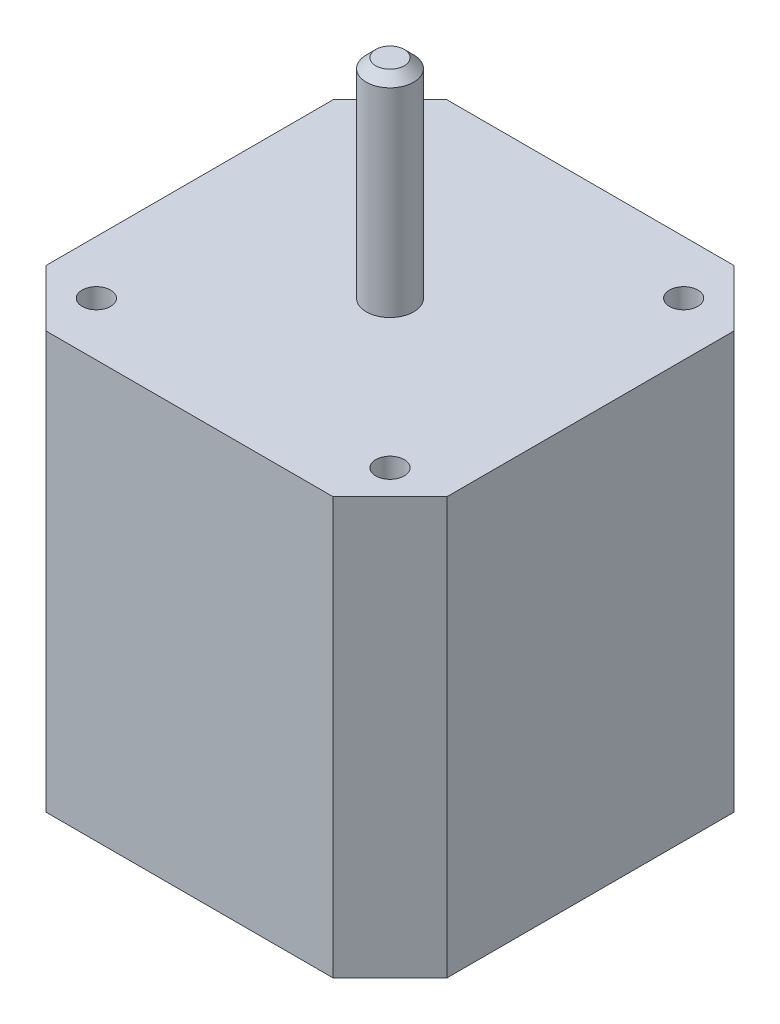
ISO-10303-21;
HEADER;
FILE_DESCRIPTION(('STEP AP214'),'2;1');
FILE_NAME('part.step','',(''),(''),'','','');
FILE_SCHEMA(('AUTOMOTIVE_DESIGN { 1 0 10303 214 1 1 1 1 }'));
ENDSEC;
DATA;
#1=APPLICATION_CONTEXT('core data for automotive mechanical design processes');
#2=APPLICATION_PROTOCOL_DEFINITION('international standard','automotive_design',2000,#1);
#3=PRODUCT_CONTEXT('',#1,'mechanical');
#4=PRODUCT('Part','Part','',(#3));
#5=PRODUCT_RELATED_PRODUCT_CATEGORY('part','',(#4));
#6=PRODUCT_DEFINITION_FORMATION('','',#4);
#7=PRODUCT_DEFINITION_CONTEXT('part definition',#1,'design');
#8=PRODUCT_DEFINITION('design','',#6,#7);
#9=PRODUCT_DEFINITION_SHAPE('','',#8);
#10=(LENGTH_UNIT() NAMED_UNIT(*) SI_UNIT(.MILLI.,.METRE.));
#11=(NAMED_UNIT(*) PLANE_ANGLE_UNIT() SI_UNIT($,.RADIAN.));
#12=(NAMED_UNIT(*) SI_UNIT($,.STERADIAN.) SOLID_ANGLE_UNIT());
#13=UNCERTAINTY_MEASURE_WITH_UNIT(LENGTH_MEASURE(1.E-05),#10,'distance_accuracy_value','');
#14=(GEOMETRIC_REPRESENTATION_CONTEXT(3) GLOBAL_UNCERTAINTY_ASSIGNED_CONTEXT((#13)) GLOBAL_UNIT_ASSIGNED_CONTEXT((#10,
#11,#12)) REPRESENTATION_CONTEXT('',''));
#15=CARTESIAN_POINT('',(0.,0.,0.));
#16=DIRECTION('',(0.,0.,1.));
#17=DIRECTION('',(1.,0.,0.));
#18=AXIS2_PLACEMENT_3D('',#15,#16,#17);
#19=CARTESIAN_POINT('',(0.,44.,0.));
#20=DIRECTION('',(0.,1.,0.));
#21=DIRECTION('',(0.,0.,1.));
#22=AXIS2_PLACEMENT_3D('',#19,#20,#21);
#23=PLANE('',#22);
#24=CARTESIAN_POINT('',(-15.5,44.,15.5));
#25=DIRECTION('',(0.,1.,0.));
#26=DIRECTION('',(0.,0.,1.));
#27=AXIS2_PLACEMENT_3D('',#24,#25,#26);
#28=CIRCLE('',#27,1.5);
#29=CARTESIAN_POINT('',(-15.5,44.,17.));
#30=VERTEX_POINT('',#29);
#31=EDGE_CURVE('E257',#30,#30,#28,.T.);
#32=ORIENTED_EDGE('',*,*,#31,.F.);
#33=EDGE_LOOP('',(#32));
#34=FACE_BOUND('',#33,.T.);
#35=CARTESIAN_POINT('',(15.5,44.,15.5));
#36=DIRECTION('',(0.,1.,0.));
#37=DIRECTION('',(0.,0.,1.));
#38=AXIS2_PLACEMENT_3D('',#35,#36,#37);
#39=CIRCLE('',#38,1.5);
#40=CARTESIAN_POINT('',(15.5,44.,17.));
#41=VERTEX_POINT('',#40);
#42=EDGE_CURVE('E251',#41,#41,#39,.T.);
#43=ORIENTED_EDGE('',*,*,#42,.F.);
#44=EDGE_LOOP('',(#43));
#45=FACE_BOUND('',#44,.T.);
#46=CARTESIAN_POINT('',(15.5,44.,-15.5));
#47=DIRECTION('',(0.,1.,0.));
#48=DIRECTION('',(0.,0.,1.));
#49=AXIS2_PLACEMENT_3D('',#46,#47,#48);
#50=CIRCLE('',#49,1.5);
#51=CARTESIAN_POINT('',(15.5,44.,-14.));
#52=VERTEX_POINT('',#51);
#53=EDGE_CURVE('E245',#52,#52,#50,.T.);
#54=ORIENTED_EDGE('',*,*,#53,.F.);
#55=EDGE_LOOP('',(#54));
#56=FACE_BOUND('',#55,.T.);
#57=CARTESIAN_POINT('',(-15.5,44.,-15.5));
#58=DIRECTION('',(0.,1.,0.));
#59=DIRECTION('',(0.,0.,1.));
#60=AXIS2_PLACEMENT_3D('',#57,#58,#59);
#61=CIRCLE('',#60,1.5);
#62=CARTESIAN_POINT('',(-15.5,44.,-14.));
#63=VERTEX_POINT('',#62);
#64=EDGE_CURVE('E239',#63,#63,#61,.T.);
#65=ORIENTED_EDGE('',*,*,#64,.F.);
#66=EDGE_LOOP('',(#65));
#67=FACE_BOUND('',#66,.T.);
#68=DIRECTION('',(1.,0.,0.));
#69=VECTOR('',#68,1.);
#70=CARTESIAN_POINT('',(0.,44.,-21.15));
#71=LINE('',#70,#69);
#72=CARTESIAN_POINT('',(-15.15,44.,-21.15));
#73=VERTEX_POINT('',#72);
#74=CARTESIAN_POINT('',(15.15,44.,-21.15));
#75=VERTEX_POINT('',#74);
#76=EDGE_CURVE('E225',#73,#75,#71,.T.);
#77=ORIENTED_EDGE('',*,*,#76,.F.);
#78=DIRECTION('',(-0.707106781186548,0.,0.707106781186547));
#79=VECTOR('',#78,1.);
#80=CARTESIAN_POINT('',(-18.15,44.,-18.15));
#81=LINE('',#80,#79);
#82=CARTESIAN_POINT('',(-21.15,44.,-15.15));
#83=VERTEX_POINT('',#82);
#84=EDGE_CURVE('E152',#73,#83,#81,.T.);
#85=ORIENTED_EDGE('',*,*,#84,.T.);
#86=DIRECTION('',(0.,0.,1.));
#87=VECTOR('',#86,1.);
#88=CARTESIAN_POINT('',(-21.15,44.,0.));
#89=LINE('',#88,#87);
#90=CARTESIAN_POINT('',(-21.15,44.,15.15));
#91=VERTEX_POINT('',#90);
#92=EDGE_CURVE('E123',#83,#91,#89,.T.);
#93=ORIENTED_EDGE('',*,*,#92,.T.);
#94=DIRECTION('',(-0.707106781186546,0.,-0.707106781186549));
#95=VECTOR('',#94,1.);
#96=CARTESIAN_POINT('',(-18.15,44.,18.15));
#97=LINE('',#96,#95);
#98=CARTESIAN_POINT('',(-15.15,44.,21.15));
#99=VERTEX_POINT('',#98);
#100=EDGE_CURVE('E59',#91,#99,#97,.F.);
#101=ORIENTED_EDGE('',*,*,#100,.T.);
#102=DIRECTION('',(1.,0.,0.));
#103=VECTOR('',#102,1.);
#104=CARTESIAN_POINT('',(0.,44.,21.15));
#105=LINE('',#104,#103);
#106=CARTESIAN_POINT('',(15.15,44.,21.15));
#107=VERTEX_POINT('',#106);
#108=EDGE_CURVE('E138',#99,#107,#105,.T.);
#109=ORIENTED_EDGE('',*,*,#108,.T.);
#110=DIRECTION('',(0.707106781186549,0.,-0.707106781186546));
#111=VECTOR('',#110,1.);
#112=CARTESIAN_POINT('',(18.15,44.,18.15));
#113=LINE('',#112,#111);
#114=CARTESIAN_POINT('',(21.15,44.,15.15));
#115=VERTEX_POINT('',#114);
#116=EDGE_CURVE('E147',#107,#115,#113,.T.);
#117=ORIENTED_EDGE('',*,*,#116,.T.);
#118=DIRECTION('',(0.,0.,1.));
#119=VECTOR('',#118,1.);
#120=CARTESIAN_POINT('',(21.15,44.,0.));
#121=LINE('',#120,#119);
#122=CARTESIAN_POINT('',(21.15,44.,-15.15));
#123=VERTEX_POINT('',#122);
#124=EDGE_CURVE('E132',#123,#115,#121,.T.);
#125=ORIENTED_EDGE('',*,*,#124,.F.);
#126=DIRECTION('',(0.707106781186546,0.,0.707106781186549));
#127=VECTOR('',#126,1.);
#128=CARTESIAN_POINT('',(18.15,44.,-18.1499999999999));
#129=LINE('',#128,#127);
#130=EDGE_CURVE('E149',#123,#75,#129,.F.);
#131=ORIENTED_EDGE('',*,*,#130,.T.);
#132=EDGE_LOOP('',(#77,#85,#93,#101,#109,#117,#125,#131));
#133=FACE_BOUND('',#132,.T.);
#134=CARTESIAN_POINT('',(0.,44.,0.));
#135=DIRECTION('',(0.,1.,0.));
#136=DIRECTION('',(0.,0.,1.));
#137=AXIS2_PLACEMENT_3D('',#134,#135,#136);
#138=CIRCLE('',#137,2.5);
#139=CARTESIAN_POINT('',(0.,44.,2.5));
#140=VERTEX_POINT('',#139);
#141=EDGE_CURVE('E233',#140,#140,#138,.F.);
#142=ORIENTED_EDGE('',*,*,#141,.T.);
#143=EDGE_LOOP('',(#142));
#144=FACE_BOUND('',#143,.T.);
#145=ADVANCED_FACE('F37',(#34,#45,#56,#67,#133,#144),#23,.T.);
#146=CARTESIAN_POINT('',(21.15,44.,0.));
#147=DIRECTION('',(1.,0.,0.));
#148=DIRECTION('',(0.,0.,-1.));
#149=AXIS2_PLACEMENT_3D('',#146,#147,#148);
#150=PLANE('',#149);
#151=DIRECTION('',(0.,0.,1.));
#152=VECTOR('',#151,1.);
#153=CARTESIAN_POINT('',(21.15,0.,0.));
#154=LINE('',#153,#152);
#155=CARTESIAN_POINT('',(21.15,0.,-15.15));
#156=VERTEX_POINT('',#155);
#157=CARTESIAN_POINT('',(21.15,0.,15.15));
#158=VERTEX_POINT('',#157);
#159=EDGE_CURVE('E134',#156,#158,#154,.T.);
#160=ORIENTED_EDGE('',*,*,#159,.F.);
#161=DIRECTION('',(0.,1.,0.));
#162=VECTOR('',#161,1.);
#163=CARTESIAN_POINT('',(21.15,44.,-15.15));
#164=LINE('',#163,#162);
#165=EDGE_CURVE('E161',#156,#123,#164,.T.);
#166=ORIENTED_EDGE('',*,*,#165,.T.);
#167=ORIENTED_EDGE('',*,*,#124,.T.);
#168=DIRECTION('',(0.,-1.,0.));
#169=VECTOR('',#168,1.);
#170=CARTESIAN_POINT('',(21.15,0.,15.15));
#171=LINE('',#170,#169);
#172=EDGE_CURVE('E158',#115,#158,#171,.T.);
#173=ORIENTED_EDGE('',*,*,#172,.T.);
#174=EDGE_LOOP('',(#160,#166,#167,#173));
#175=FACE_BOUND('',#174,.T.);
#176=ADVANCED_FACE('F182',(#175),#150,.T.);
#177=CARTESIAN_POINT('',(0.,44.,-21.15));
#178=DIRECTION('',(0.,0.,-1.));
#179=DIRECTION('',(-1.,0.,0.));
#180=AXIS2_PLACEMENT_3D('',#177,#178,#179);
#181=PLANE('',#180);
#182=DIRECTION('',(1.,0.,0.));
#183=VECTOR('',#182,1.);
#184=CARTESIAN_POINT('',(0.,0.,-21.15));
#185=LINE('',#184,#183);
#186=CARTESIAN_POINT('',(-15.15,0.,-21.15));
#187=VERTEX_POINT('',#186);
#188=CARTESIAN_POINT('',(15.15,0.,-21.15));
#189=VERTEX_POINT('',#188);
#190=EDGE_CURVE('E130',#187,#189,#185,.T.);
#191=ORIENTED_EDGE('',*,*,#190,.F.);
#192=DIRECTION('',(0.,1.,0.));
#193=VECTOR('',#192,1.);
#194=CARTESIAN_POINT('',(-15.15,44.,-21.15));
#195=LINE('',#194,#193);
#196=EDGE_CURVE('E109',#187,#73,#195,.T.);
#197=ORIENTED_EDGE('',*,*,#196,.T.);
#198=ORIENTED_EDGE('',*,*,#76,.T.);
#199=DIRECTION('',(0.,-1.,0.));
#200=VECTOR('',#199,1.);
#201=CARTESIAN_POINT('',(15.15,44.,-21.15));
#202=LINE('',#201,#200);
#203=EDGE_CURVE('E114',#75,#189,#202,.T.);
#204=ORIENTED_EDGE('',*,*,#203,.T.);
#205=EDGE_LOOP('',(#191,#197,#198,#204));
#206=FACE_BOUND('',#205,.T.);
#207=ADVANCED_FACE('F189',(#206),#181,.T.);
#208=CARTESIAN_POINT('',(-21.15,44.,0.));
#209=DIRECTION('',(1.,0.,0.));
#210=DIRECTION('',(0.,0.,-1.));
#211=AXIS2_PLACEMENT_3D('',#208,#209,#210);
#212=PLANE('',#211);
#213=ORIENTED_EDGE('',*,*,#92,.F.);
#214=DIRECTION('',(0.,-1.,0.));
#215=VECTOR('',#214,1.);
#216=CARTESIAN_POINT('',(-21.15,0.,-15.15));
#217=LINE('',#216,#215);
#218=CARTESIAN_POINT('',(-21.15,0.,-15.15));
#219=VERTEX_POINT('',#218);
#220=EDGE_CURVE('E108',#83,#219,#217,.T.);
#221=ORIENTED_EDGE('',*,*,#220,.T.);
#222=DIRECTION('',(0.,0.,1.));
#223=VECTOR('',#222,1.);
#224=CARTESIAN_POINT('',(-21.15,0.,0.));
#225=LINE('',#224,#223);
#226=CARTESIAN_POINT('',(-21.15,0.,15.15));
#227=VERTEX_POINT('',#226);
#228=EDGE_CURVE('E121',#219,#227,#225,.T.);
#229=ORIENTED_EDGE('',*,*,#228,.T.);
#230=DIRECTION('',(0.,1.,0.));
#231=VECTOR('',#230,1.);
#232=CARTESIAN_POINT('',(-21.15,44.,15.15));
#233=LINE('',#232,#231);
#234=EDGE_CURVE('E125',#227,#91,#233,.T.);
#235=ORIENTED_EDGE('',*,*,#234,.T.);
#236=EDGE_LOOP('',(#213,#221,#229,#235));
#237=FACE_BOUND('',#236,.T.);
#238=ADVANCED_FACE('F120',(#237),#212,.F.);
#239=CARTESIAN_POINT('',(0.,44.,21.15));
#240=DIRECTION('',(0.,0.,-1.));
#241=DIRECTION('',(-1.,0.,0.));
#242=AXIS2_PLACEMENT_3D('',#239,#240,#241);
#243=PLANE('',#242);
#244=ORIENTED_EDGE('',*,*,#108,.F.);
#245=DIRECTION('',(0.,-1.,0.));
#246=VECTOR('',#245,1.);
#247=CARTESIAN_POINT('',(-15.15,44.,21.15));
#248=LINE('',#247,#246);
#249=CARTESIAN_POINT('',(-15.15,0.,21.15));
#250=VERTEX_POINT('',#249);
#251=EDGE_CURVE('E155',#99,#250,#248,.T.);
#252=ORIENTED_EDGE('',*,*,#251,.T.);
#253=DIRECTION('',(1.,0.,0.));
#254=VECTOR('',#253,1.);
#255=CARTESIAN_POINT('',(0.,0.,21.15));
#256=LINE('',#255,#254);
#257=CARTESIAN_POINT('',(15.15,0.,21.15));
#258=VERTEX_POINT('',#257);
#259=EDGE_CURVE('E129',#250,#258,#256,.T.);
#260=ORIENTED_EDGE('',*,*,#259,.T.);
#261=DIRECTION('',(0.,1.,0.));
#262=VECTOR('',#261,1.);
#263=CARTESIAN_POINT('',(15.15,44.,21.15));
#264=LINE('',#263,#262);
#265=EDGE_CURVE('E52',#258,#107,#264,.T.);
#266=ORIENTED_EDGE('',*,*,#265,.T.);
#267=EDGE_LOOP('',(#244,#252,#260,#266));
#268=FACE_BOUND('',#267,.T.);
#269=ADVANCED_FACE('F200',(#268),#243,.F.);
#270=CARTESIAN_POINT('',(0.,0.,0.));
#271=DIRECTION('',(0.,1.,0.));
#272=DIRECTION('',(0.,0.,1.));
#273=AXIS2_PLACEMENT_3D('',#270,#271,#272);
#274=PLANE('',#273);
#275=ORIENTED_EDGE('',*,*,#228,.F.);
#276=DIRECTION('',(0.707106781186548,0.,-0.707106781186547));
#277=VECTOR('',#276,1.);
#278=CARTESIAN_POINT('',(-21.15,0.,-15.15));
#279=LINE('',#278,#277);
#280=EDGE_CURVE('E104',#219,#187,#279,.T.);
#281=ORIENTED_EDGE('',*,*,#280,.T.);
#282=ORIENTED_EDGE('',*,*,#190,.T.);
#283=DIRECTION('',(-0.707106781186546,0.,-0.707106781186549));
#284=VECTOR('',#283,1.);
#285=CARTESIAN_POINT('',(15.15,0.,-21.15));
#286=LINE('',#285,#284);
#287=EDGE_CURVE('E141',#189,#156,#286,.F.);
#288=ORIENTED_EDGE('',*,*,#287,.T.);
#289=ORIENTED_EDGE('',*,*,#159,.T.);
#290=DIRECTION('',(-0.707106781186549,0.,0.707106781186546));
#291=VECTOR('',#290,1.);
#292=CARTESIAN_POINT('',(21.15,0.,15.15));
#293=LINE('',#292,#291);
#294=EDGE_CURVE('E124',#158,#258,#293,.T.);
#295=ORIENTED_EDGE('',*,*,#294,.T.);
#296=ORIENTED_EDGE('',*,*,#259,.F.);
#297=DIRECTION('',(0.707106781186546,0.,0.707106781186549));
#298=VECTOR('',#297,1.);
#299=CARTESIAN_POINT('',(-15.15,0.,21.15));
#300=LINE('',#299,#298);
#301=EDGE_CURVE('E115',#250,#227,#300,.F.);
#302=ORIENTED_EDGE('',*,*,#301,.T.);
#303=EDGE_LOOP('',(#275,#281,#282,#288,#289,#295,#296,#302));
#304=FACE_BOUND('',#303,.T.);
#305=ADVANCED_FACE('F127',(#304),#274,.F.);
#306=CARTESIAN_POINT('',(0.,66.,0.));
#307=DIRECTION('',(0.,-1.,0.));
#308=DIRECTION('',(0.,0.,-1.));
#309=AXIS2_PLACEMENT_3D('',#306,#307,#308);
#310=CYLINDRICAL_SURFACE('',#309,2.5);
#311=CARTESIAN_POINT('',(0.,65.,0.));
#312=DIRECTION('',(0.,1.,0.));
#313=DIRECTION('',(0.,0.,1.));
#314=AXIS2_PLACEMENT_3D('',#311,#312,#313);
#315=CIRCLE('',#314,2.5);
#316=CARTESIAN_POINT('',(0.,65.,2.5));
#317=VERTEX_POINT('',#316);
#318=EDGE_CURVE('E11',#317,#317,#315,.F.);
#319=ORIENTED_EDGE('',*,*,#318,.T.);
#320=EDGE_LOOP('',(#319));
#321=FACE_BOUND('',#320,.T.);
#322=ORIENTED_EDGE('',*,*,#141,.F.);
#323=EDGE_LOOP('',(#322));
#324=FACE_BOUND('',#323,.T.);
#325=ADVANCED_FACE('F196',(#321,#324),#310,.T.);
#326=CARTESIAN_POINT('',(0.,66.,0.));
#327=DIRECTION('',(0.,1.,0.));
#328=DIRECTION('',(0.,0.,1.));
#329=AXIS2_PLACEMENT_3D('',#326,#327,#328);
#330=PLANE('',#329);
#331=CARTESIAN_POINT('',(0.,66.,0.));
#332=DIRECTION('',(0.,1.,0.));
#333=DIRECTION('',(0.,0.,1.));
#334=AXIS2_PLACEMENT_3D('',#331,#332,#333);
#335=CIRCLE('',#334,1.49999999999999);
#336=CARTESIAN_POINT('',(0.,66.,1.49999999999999));
#337=VERTEX_POINT('',#336);
#338=EDGE_CURVE('E45',#337,#337,#335,.T.);
#339=ORIENTED_EDGE('',*,*,#338,.T.);
#340=EDGE_LOOP('',(#339));
#341=FACE_BOUND('',#340,.T.);
#342=ADVANCED_FACE('F165',(#341),#330,.T.);
#343=CARTESIAN_POINT('',(-21.15,44.,-15.15));
#344=DIRECTION('',(-0.707106781186547,0.,-0.707106781186548));
#345=DIRECTION('',(0.,1.,0.));
#346=AXIS2_PLACEMENT_3D('',#343,#344,#345);
#347=PLANE('',#346);
#348=ORIENTED_EDGE('',*,*,#84,.F.);
#349=ORIENTED_EDGE('',*,*,#196,.F.);
#350=ORIENTED_EDGE('',*,*,#280,.F.);
#351=ORIENTED_EDGE('',*,*,#220,.F.);
#352=EDGE_LOOP('',(#348,#349,#350,#351));
#353=FACE_BOUND('',#352,.T.);
#354=ADVANCED_FACE('F107',(#353),#347,.T.);
#355=CARTESIAN_POINT('',(-15.15,44.,21.15));
#356=DIRECTION('',(0.707106781186549,0.,-0.707106781186546));
#357=DIRECTION('',(0.,-1.,0.));
#358=AXIS2_PLACEMENT_3D('',#355,#356,#357);
#359=PLANE('',#358);
#360=ORIENTED_EDGE('',*,*,#100,.F.);
#361=ORIENTED_EDGE('',*,*,#234,.F.);
#362=ORIENTED_EDGE('',*,*,#301,.F.);
#363=ORIENTED_EDGE('',*,*,#251,.F.);
#364=EDGE_LOOP('',(#360,#361,#362,#363));
#365=FACE_BOUND('',#364,.T.);
#366=ADVANCED_FACE('F210',(#365),#359,.F.);
#367=CARTESIAN_POINT('',(15.15,44.,-21.15));
#368=DIRECTION('',(-0.707106781186549,0.,0.707106781186546));
#369=DIRECTION('',(0.,-1.,0.));
#370=AXIS2_PLACEMENT_3D('',#367,#368,#369);
#371=PLANE('',#370);
#372=ORIENTED_EDGE('',*,*,#130,.F.);
#373=ORIENTED_EDGE('',*,*,#165,.F.);
#374=ORIENTED_EDGE('',*,*,#287,.F.);
#375=ORIENTED_EDGE('',*,*,#203,.F.);
#376=EDGE_LOOP('',(#372,#373,#374,#375));
#377=FACE_BOUND('',#376,.T.);
#378=ADVANCED_FACE('F178',(#377),#371,.F.);
#379=CARTESIAN_POINT('',(21.15,44.,15.15));
#380=DIRECTION('',(0.707106781186546,0.,0.707106781186549));
#381=DIRECTION('',(0.,1.,0.));
#382=AXIS2_PLACEMENT_3D('',#379,#380,#381);
#383=PLANE('',#382);
#384=ORIENTED_EDGE('',*,*,#116,.F.);
#385=ORIENTED_EDGE('',*,*,#265,.F.);
#386=ORIENTED_EDGE('',*,*,#294,.F.);
#387=ORIENTED_EDGE('',*,*,#172,.F.);
#388=EDGE_LOOP('',(#384,#385,#386,#387));
#389=FACE_BOUND('',#388,.T.);
#390=ADVANCED_FACE('F169',(#389),#383,.T.);
#391=CARTESIAN_POINT('',(0.,66.,0.));
#392=DIRECTION('',(0.,-1.,0.));
#393=DIRECTION('',(0.,0.,-1.));
#394=AXIS2_PLACEMENT_3D('',#391,#392,#393);
#395=CONICAL_SURFACE('',#394,1.49999999999999,0.785398163397441);
#396=ORIENTED_EDGE('',*,*,#318,.F.);
#397=EDGE_LOOP('',(#396));
#398=FACE_BOUND('',#397,.T.);
#399=ORIENTED_EDGE('',*,*,#338,.F.);
#400=EDGE_LOOP('',(#399));
#401=FACE_BOUND('',#400,.T.);
#402=ADVANCED_FACE('F39',(#398,#401),#395,.T.);
#403=CARTESIAN_POINT('',(-15.5,34.,-15.5));
#404=DIRECTION('',(0.,1.,0.));
#405=DIRECTION('',(0.,0.,1.));
#406=AXIS2_PLACEMENT_3D('',#403,#404,#405);
#407=CYLINDRICAL_SURFACE('',#406,1.5);
#408=CARTESIAN_POINT('',(-15.5,34.,-15.5));
#409=DIRECTION('',(0.,1.,0.));
#410=DIRECTION('',(0.,0.,1.));
#411=AXIS2_PLACEMENT_3D('',#408,#409,#410);
#412=CIRCLE('',#411,1.5);
#413=CARTESIAN_POINT('',(-15.5,34.,-14.));
#414=VERTEX_POINT('',#413);
#415=EDGE_CURVE('E236',#414,#414,#412,.T.);
#416=ORIENTED_EDGE('',*,*,#415,.F.);
#417=EDGE_LOOP('',(#416));
#418=FACE_BOUND('',#417,.T.);
#419=ORIENTED_EDGE('',*,*,#64,.T.);
#420=EDGE_LOOP('',(#419));
#421=FACE_BOUND('',#420,.T.);
#422=ADVANCED_FACE('F168',(#418,#421),#407,.F.);
#423=CARTESIAN_POINT('',(-15.5,34.,-15.5));
#424=DIRECTION('',(0.,1.,0.));
#425=DIRECTION('',(0.,0.,1.));
#426=AXIS2_PLACEMENT_3D('',#423,#424,#425);
#427=PLANE('',#426);
#428=ORIENTED_EDGE('',*,*,#415,.T.);
#429=EDGE_LOOP('',(#428));
#430=FACE_BOUND('',#429,.T.);
#431=ADVANCED_FACE('F175',(#430),#427,.T.);
#432=CARTESIAN_POINT('',(15.5,34.,-15.5));
#433=DIRECTION('',(0.,1.,0.));
#434=DIRECTION('',(0.,0.,1.));
#435=AXIS2_PLACEMENT_3D('',#432,#433,#434);
#436=CYLINDRICAL_SURFACE('',#435,1.5);
#437=CARTESIAN_POINT('',(15.5,34.,-15.5));
#438=DIRECTION('',(0.,1.,0.));
#439=DIRECTION('',(0.,0.,1.));
#440=AXIS2_PLACEMENT_3D('',#437,#438,#439);
#441=CIRCLE('',#440,1.5);
#442=CARTESIAN_POINT('',(15.5,34.,-14.));
#443=VERTEX_POINT('',#442);
#444=EDGE_CURVE('E243',#443,#443,#441,.T.);
#445=ORIENTED_EDGE('',*,*,#444,.F.);
#446=EDGE_LOOP('',(#445));
#447=FACE_BOUND('',#446,.T.);
#448=ORIENTED_EDGE('',*,*,#53,.T.);
#449=EDGE_LOOP('',(#448));
#450=FACE_BOUND('',#449,.T.);
#451=ADVANCED_FACE('F285',(#447,#450),#436,.F.);
#452=CARTESIAN_POINT('',(15.5,34.,-15.5));
#453=DIRECTION('',(0.,1.,0.));
#454=DIRECTION('',(0.,0.,1.));
#455=AXIS2_PLACEMENT_3D('',#452,#453,#454);
#456=PLANE('',#455);
#457=ORIENTED_EDGE('',*,*,#444,.T.);
#458=EDGE_LOOP('',(#457));
#459=FACE_BOUND('',#458,.T.);
#460=ADVANCED_FACE('F281',(#459),#456,.T.);
#461=CARTESIAN_POINT('',(15.5,34.,15.5));
#462=DIRECTION('',(0.,1.,0.));
#463=DIRECTION('',(0.,0.,1.));
#464=AXIS2_PLACEMENT_3D('',#461,#462,#463);
#465=CYLINDRICAL_SURFACE('',#464,1.5);
#466=CARTESIAN_POINT('',(15.5,34.,15.5));
#467=DIRECTION('',(0.,1.,0.));
#468=DIRECTION('',(0.,0.,1.));
#469=AXIS2_PLACEMENT_3D('',#466,#467,#468);
#470=CIRCLE('',#469,1.5);
#471=CARTESIAN_POINT('',(15.5,34.,17.));
#472=VERTEX_POINT('',#471);
#473=EDGE_CURVE('E248',#472,#472,#470,.T.);
#474=ORIENTED_EDGE('',*,*,#473,.F.);
#475=EDGE_LOOP('',(#474));
#476=FACE_BOUND('',#475,.T.);
#477=ORIENTED_EDGE('',*,*,#42,.T.);
#478=EDGE_LOOP('',(#477));
#479=FACE_BOUND('',#478,.T.);
#480=ADVANCED_FACE('F275',(#476,#479),#465,.F.);
#481=CARTESIAN_POINT('',(15.5,34.,15.5));
#482=DIRECTION('',(0.,1.,0.));
#483=DIRECTION('',(0.,0.,1.));
#484=AXIS2_PLACEMENT_3D('',#481,#482,#483);
#485=PLANE('',#484);
#486=ORIENTED_EDGE('',*,*,#473,.T.);
#487=EDGE_LOOP('',(#486));
#488=FACE_BOUND('',#487,.T.);
#489=ADVANCED_FACE('F268',(#488),#485,.T.);
#490=CARTESIAN_POINT('',(-15.5,34.,15.5));
#491=DIRECTION('',(0.,1.,0.));
#492=DIRECTION('',(0.,0.,1.));
#493=AXIS2_PLACEMENT_3D('',#490,#491,#492);
#494=CYLINDRICAL_SURFACE('',#493,1.5);
#495=CARTESIAN_POINT('',(-15.5,34.,15.5));
#496=DIRECTION('',(0.,1.,0.));
#497=DIRECTION('',(0.,0.,1.));
#498=AXIS2_PLACEMENT_3D('',#495,#496,#497);
#499=CIRCLE('',#498,1.5);
#500=CARTESIAN_POINT('',(-15.5,34.,17.));
#501=VERTEX_POINT('',#500);
#502=EDGE_CURVE('E254',#501,#501,#499,.T.);
#503=ORIENTED_EDGE('',*,*,#502,.F.);
#504=EDGE_LOOP('',(#503));
#505=FACE_BOUND('',#504,.T.);
#506=ORIENTED_EDGE('',*,*,#31,.T.);
#507=EDGE_LOOP('',(#506));
#508=FACE_BOUND('',#507,.T.);
#509=ADVANCED_FACE('F265',(#505,#508),#494,.F.);
#510=CARTESIAN_POINT('',(-15.5,34.,15.5));
#511=DIRECTION('',(0.,1.,0.));
#512=DIRECTION('',(0.,0.,1.));
#513=AXIS2_PLACEMENT_3D('',#510,#511,#512);
#514=PLANE('',#513);
#515=ORIENTED_EDGE('',*,*,#502,.T.);
#516=EDGE_LOOP('',(#515));
#517=FACE_BOUND('',#516,.T.);
#518=ADVANCED_FACE('F263',(#517),#514,.T.);
#519=CLOSED_SHELL('',(#145,#176,#207,#238,#269,#305,#325,#342,#354,#366,#378,#390,#402,#422,
#431,#451,#460,#480,#489,#509,#518));
#520=MANIFOLD_SOLID_BREP('B2',#519);
#521=ADVANCED_BREP_SHAPE_REPRESENTATION('',(#18,#520),#14);
#522=SHAPE_DEFINITION_REPRESENTATION(#9,#521);
ENDSEC;
END-ISO-10303-21;
